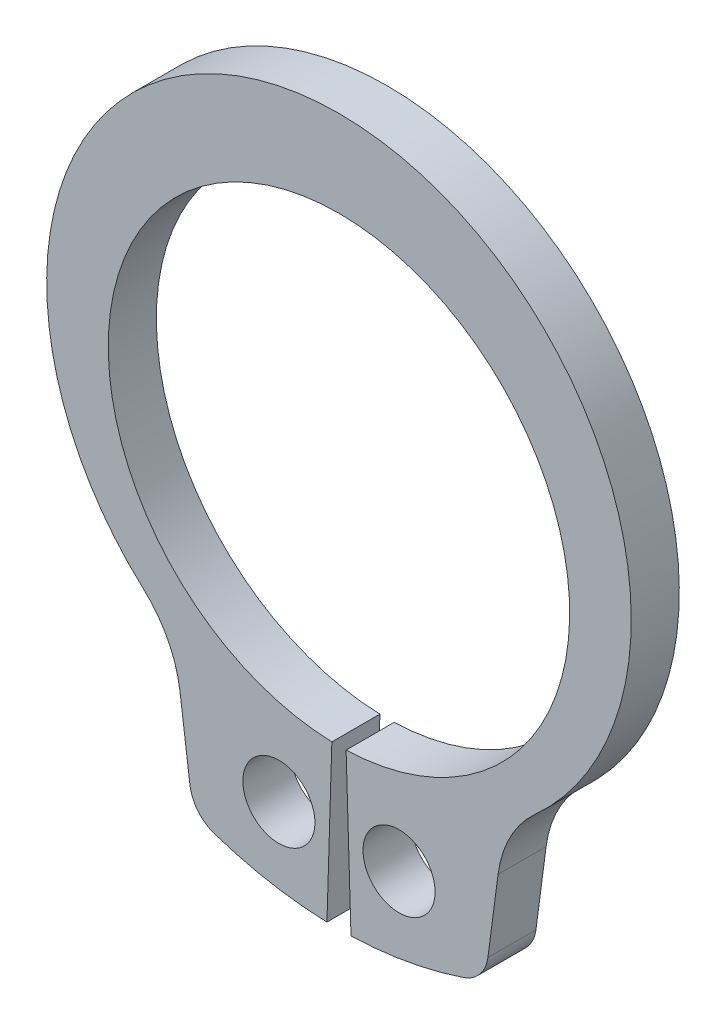
ISO-10303-21;
HEADER;
FILE_DESCRIPTION(('STEP AP214'),'2;1');
FILE_NAME('part.step','',(''),(''),'','','');
FILE_SCHEMA(('AUTOMOTIVE_DESIGN { 1 0 10303 214 1 1 1 1 }'));
ENDSEC;
DATA;
#1=APPLICATION_CONTEXT('core data for automotive mechanical design processes');
#2=APPLICATION_PROTOCOL_DEFINITION('international standard','automotive_design',2000,#1);
#3=PRODUCT_CONTEXT('',#1,'mechanical');
#4=PRODUCT('Part','Part','',(#3));
#5=PRODUCT_RELATED_PRODUCT_CATEGORY('part','',(#4));
#6=PRODUCT_DEFINITION_FORMATION('','',#4);
#7=PRODUCT_DEFINITION_CONTEXT('part definition',#1,'design');
#8=PRODUCT_DEFINITION('design','',#6,#7);
#9=PRODUCT_DEFINITION_SHAPE('','',#8);
#10=(LENGTH_UNIT() NAMED_UNIT(*) SI_UNIT(.MILLI.,.METRE.));
#11=(NAMED_UNIT(*) PLANE_ANGLE_UNIT() SI_UNIT($,.RADIAN.));
#12=(NAMED_UNIT(*) SI_UNIT($,.STERADIAN.) SOLID_ANGLE_UNIT());
#13=UNCERTAINTY_MEASURE_WITH_UNIT(LENGTH_MEASURE(1.E-05),#10,'distance_accuracy_value','');
#14=(GEOMETRIC_REPRESENTATION_CONTEXT(3) GLOBAL_UNCERTAINTY_ASSIGNED_CONTEXT((#13)) GLOBAL_UNIT_ASSIGNED_CONTEXT((#10,
#11,#12)) REPRESENTATION_CONTEXT('',''));
#15=CARTESIAN_POINT('',(0.,0.,0.));
#16=DIRECTION('',(0.,0.,1.));
#17=DIRECTION('',(1.,0.,0.));
#18=AXIS2_PLACEMENT_3D('',#15,#16,#17);
#19=CARTESIAN_POINT('',(0.,0.,-1.));
#20=DIRECTION('',(0.,0.,1.));
#21=DIRECTION('',(1.,0.,0.));
#22=AXIS2_PLACEMENT_3D('',#19,#20,#21);
#23=CYLINDRICAL_SURFACE('',#22,4.8);
#24=CARTESIAN_POINT('',(0.,0.,0.));
#25=DIRECTION('',(0.,0.,-1.));
#26=DIRECTION('',(1.,0.,0.));
#27=AXIS2_PLACEMENT_3D('',#24,#25,#26);
#28=CIRCLE('',#27,4.8);
#29=CARTESIAN_POINT('',(-0.148148148148148,-4.79771321841982,0.));
#30=VERTEX_POINT('',#29);
#31=CARTESIAN_POINT('',(0.148148148148148,-4.79771321841982,0.));
#32=VERTEX_POINT('',#31);
#33=EDGE_CURVE('E153',#30,#32,#28,.T.);
#34=ORIENTED_EDGE('',*,*,#33,.F.);
#35=DIRECTION('',(0.,0.,1.));
#36=VECTOR('',#35,1.);
#37=CARTESIAN_POINT('',(-0.148148148148148,-4.79771321841982,-1.));
#38=LINE('',#37,#36);
#39=CARTESIAN_POINT('',(-0.148148148148148,-4.79771321841982,-1.));
#40=VERTEX_POINT('',#39);
#41=EDGE_CURVE('E11',#40,#30,#38,.T.);
#42=ORIENTED_EDGE('',*,*,#41,.F.);
#43=CARTESIAN_POINT('',(0.,0.,-1.));
#44=DIRECTION('',(0.,0.,-1.));
#45=DIRECTION('',(1.,0.,0.));
#46=AXIS2_PLACEMENT_3D('',#43,#44,#45);
#47=CIRCLE('',#46,4.8);
#48=CARTESIAN_POINT('',(0.148148148148148,-4.79771321841982,-1.));
#49=VERTEX_POINT('',#48);
#50=EDGE_CURVE('E186',#40,#49,#47,.T.);
#51=ORIENTED_EDGE('',*,*,#50,.T.);
#52=DIRECTION('',(0.,0.,1.));
#53=VECTOR('',#52,1.);
#54=CARTESIAN_POINT('',(0.148148148148148,-4.79771321841982,-1.));
#55=LINE('',#54,#53);
#56=EDGE_CURVE('E35',#49,#32,#55,.T.);
#57=ORIENTED_EDGE('',*,*,#56,.T.);
#58=EDGE_LOOP('',(#34,#42,#51,#57));
#59=FACE_BOUND('',#58,.T.);
#60=ADVANCED_FACE('F32',(#59),#23,.F.);
#61=CARTESIAN_POINT('',(-0.148148148148148,-4.79771321841982,-1.));
#62=DIRECTION('',(0.999523587170796,-0.0308641975308642,0.));
#63=DIRECTION('',(0.0308641975308642,0.999523587170796,0.));
#64=AXIS2_PLACEMENT_3D('',#61,#62,#63);
#65=PLANE('',#64);
#66=DIRECTION('',(0.0308641975308642,0.999523587170796,0.));
#67=VECTOR('',#66,1.);
#68=CARTESIAN_POINT('',(-0.148148148148148,-4.79771321841982,0.));
#69=LINE('',#68,#67);
#70=CARTESIAN_POINT('',(-0.25,-8.09614105608345,0.));
#71=VERTEX_POINT('',#70);
#72=EDGE_CURVE('E184',#71,#30,#69,.T.);
#73=ORIENTED_EDGE('',*,*,#72,.F.);
#74=DIRECTION('',(0.,0.,1.));
#75=VECTOR('',#74,1.);
#76=CARTESIAN_POINT('',(-0.25,-8.09614105608345,-1.));
#77=LINE('',#76,#75);
#78=CARTESIAN_POINT('',(-0.25,-8.09614105608345,-1.));
#79=VERTEX_POINT('',#78);
#80=EDGE_CURVE('E41',#79,#71,#77,.T.);
#81=ORIENTED_EDGE('',*,*,#80,.F.);
#82=DIRECTION('',(0.0308641975308642,0.999523587170796,0.));
#83=VECTOR('',#82,1.);
#84=CARTESIAN_POINT('',(-0.148148148148148,-4.79771321841982,-1.));
#85=LINE('',#84,#83);
#86=EDGE_CURVE('E143',#79,#40,#85,.T.);
#87=ORIENTED_EDGE('',*,*,#86,.T.);
#88=ORIENTED_EDGE('',*,*,#41,.T.);
#89=EDGE_LOOP('',(#73,#81,#87,#88));
#90=FACE_BOUND('',#89,.T.);
#91=ADVANCED_FACE('F206',(#90),#65,.T.);
#92=CARTESIAN_POINT('',(0.,0.,-1.));
#93=DIRECTION('',(0.,0.,1.));
#94=DIRECTION('',(1.,0.,0.));
#95=AXIS2_PLACEMENT_3D('',#92,#93,#94);
#96=CYLINDRICAL_SURFACE('',#95,8.1);
#97=CARTESIAN_POINT('',(0.,0.,0.));
#98=DIRECTION('',(0.,0.,1.));
#99=DIRECTION('',(1.,0.,0.));
#100=AXIS2_PLACEMENT_3D('',#97,#98,#99);
#101=CIRCLE('',#100,8.1);
#102=CARTESIAN_POINT('',(-2.59511535496144,-7.67302914724317,0.));
#103=VERTEX_POINT('',#102);
#104=EDGE_CURVE('E130',#103,#71,#101,.T.);
#105=ORIENTED_EDGE('',*,*,#104,.F.);
#106=DIRECTION('',(0.,0.,1.));
#107=VECTOR('',#106,1.);
#108=CARTESIAN_POINT('',(-2.59511535496144,-7.67302914724317,-1.));
#109=LINE('',#108,#107);
#110=CARTESIAN_POINT('',(-2.59511535496144,-7.67302914724317,-1.));
#111=VERTEX_POINT('',#110);
#112=EDGE_CURVE('E125',#111,#103,#109,.T.);
#113=ORIENTED_EDGE('',*,*,#112,.F.);
#114=CARTESIAN_POINT('',(0.,0.,-1.));
#115=DIRECTION('',(0.,0.,1.));
#116=DIRECTION('',(1.,0.,0.));
#117=AXIS2_PLACEMENT_3D('',#114,#115,#116);
#118=CIRCLE('',#117,8.1);
#119=EDGE_CURVE('E128',#111,#79,#118,.T.);
#120=ORIENTED_EDGE('',*,*,#119,.T.);
#121=ORIENTED_EDGE('',*,*,#80,.T.);
#122=EDGE_LOOP('',(#105,#113,#120,#121));
#123=FACE_BOUND('',#122,.T.);
#124=ADVANCED_FACE('F127',(#123),#96,.T.);
#125=CARTESIAN_POINT('',(-2.35482689616871,-6.9625634854614,-1.));
#126=DIRECTION('',(0.,0.,1.));
#127=DIRECTION('',(1.,0.,0.));
#128=AXIS2_PLACEMENT_3D('',#125,#126,#127);
#129=CYLINDRICAL_SURFACE('',#128,0.750000000000001);
#130=CARTESIAN_POINT('',(-2.35482689616871,-6.9625634854614,0.));
#131=DIRECTION('',(0.,0.,1.));
#132=DIRECTION('',(1.,0.,0.));
#133=AXIS2_PLACEMENT_3D('',#130,#131,#132);
#134=CIRCLE('',#133,0.750000000000001);
#135=CARTESIAN_POINT('',(-3.09841054219907,-7.06045812962644,0.));
#136=VERTEX_POINT('',#135);
#137=EDGE_CURVE('E181',#136,#103,#134,.T.);
#138=ORIENTED_EDGE('',*,*,#137,.F.);
#139=DIRECTION('',(0.,0.,1.));
#140=VECTOR('',#139,1.);
#141=CARTESIAN_POINT('',(-3.09841054219907,-7.06045812962644,-1.));
#142=LINE('',#141,#140);
#143=CARTESIAN_POINT('',(-3.09841054219907,-7.06045812962644,-1.));
#144=VERTEX_POINT('',#143);
#145=EDGE_CURVE('E135',#144,#136,#142,.T.);
#146=ORIENTED_EDGE('',*,*,#145,.F.);
#147=CARTESIAN_POINT('',(-2.35482689616871,-6.9625634854614,-1.));
#148=DIRECTION('',(0.,0.,1.));
#149=DIRECTION('',(1.,0.,0.));
#150=AXIS2_PLACEMENT_3D('',#147,#148,#149);
#151=CIRCLE('',#150,0.750000000000001);
#152=EDGE_CURVE('E141',#144,#111,#151,.T.);
#153=ORIENTED_EDGE('',*,*,#152,.T.);
#154=ORIENTED_EDGE('',*,*,#112,.T.);
#155=EDGE_LOOP('',(#138,#146,#153,#154));
#156=FACE_BOUND('',#155,.T.);
#157=ADVANCED_FACE('F145',(#156),#129,.T.);
#158=CARTESIAN_POINT('',(-3.30965181475856,-5.45592136480539,-1.));
#159=DIRECTION('',(-0.99144486137381,-0.130526192220052,0.));
#160=DIRECTION('',(0.130526192220052,-0.99144486137381,0.));
#161=AXIS2_PLACEMENT_3D('',#158,#159,#160);
#162=PLANE('',#161);
#163=DIRECTION('',(0.130526192220052,-0.99144486137381,0.));
#164=VECTOR('',#163,1.);
#165=CARTESIAN_POINT('',(-3.30965181475856,-5.45592136480539,0.));
#166=LINE('',#165,#164);
#167=CARTESIAN_POINT('',(-3.30965181475856,-5.45592136480539,0.));
#168=VERTEX_POINT('',#167);
#169=EDGE_CURVE('E178',#168,#136,#166,.T.);
#170=ORIENTED_EDGE('',*,*,#169,.F.);
#171=DIRECTION('',(0.,0.,1.));
#172=VECTOR('',#171,1.);
#173=CARTESIAN_POINT('',(-3.30965181475856,-5.45592136480539,-1.));
#174=LINE('',#173,#172);
#175=CARTESIAN_POINT('',(-3.30965181475856,-5.45592136480539,-1.));
#176=VERTEX_POINT('',#175);
#177=EDGE_CURVE('E190',#176,#168,#174,.T.);
#178=ORIENTED_EDGE('',*,*,#177,.F.);
#179=DIRECTION('',(0.130526192220052,-0.99144486137381,0.));
#180=VECTOR('',#179,1.);
#181=CARTESIAN_POINT('',(-3.30965181475856,-5.45592136480539,-1.));
#182=LINE('',#181,#180);
#183=EDGE_CURVE('E146',#176,#144,#182,.T.);
#184=ORIENTED_EDGE('',*,*,#183,.T.);
#185=ORIENTED_EDGE('',*,*,#145,.T.);
#186=EDGE_LOOP('',(#170,#178,#184,#185));
#187=FACE_BOUND('',#186,.T.);
#188=ADVANCED_FACE('F219',(#187),#162,.T.);
#189=CARTESIAN_POINT('',(-5.68605087745158,-5.76878023667328,-1.));
#190=DIRECTION('',(0.,0.,1.));
#191=DIRECTION('',(1.,0.,0.));
#192=AXIS2_PLACEMENT_3D('',#189,#190,#191);
#193=CYLINDRICAL_SURFACE('',#192,2.3969049165277);
#194=CARTESIAN_POINT('',(-5.68605087745158,-5.76878023667328,0.));
#195=DIRECTION('',(0.,0.,-1.));
#196=DIRECTION('',(1.,0.,0.));
#197=AXIS2_PLACEMENT_3D('',#194,#195,#196);
#198=CIRCLE('',#197,2.3969049165277);
#199=CARTESIAN_POINT('',(-4.07842108653022,-3.99095020142895,0.));
#200=VERTEX_POINT('',#199);
#201=EDGE_CURVE('E175',#200,#168,#198,.T.);
#202=ORIENTED_EDGE('',*,*,#201,.F.);
#203=DIRECTION('',(0.,0.,1.));
#204=VECTOR('',#203,1.);
#205=CARTESIAN_POINT('',(-4.07842108653022,-3.99095020142895,-1.));
#206=LINE('',#205,#204);
#207=CARTESIAN_POINT('',(-4.07842108653022,-3.99095020142895,-1.));
#208=VERTEX_POINT('',#207);
#209=EDGE_CURVE('E192',#208,#200,#206,.T.);
#210=ORIENTED_EDGE('',*,*,#209,.F.);
#211=CARTESIAN_POINT('',(-5.68605087745158,-5.76878023667328,-1.));
#212=DIRECTION('',(0.,0.,-1.));
#213=DIRECTION('',(1.,0.,0.));
#214=AXIS2_PLACEMENT_3D('',#211,#212,#213);
#215=CIRCLE('',#214,2.3969049165277);
#216=EDGE_CURVE('E148',#208,#176,#215,.T.);
#217=ORIENTED_EDGE('',*,*,#216,.T.);
#218=ORIENTED_EDGE('',*,*,#177,.T.);
#219=EDGE_LOOP('',(#202,#210,#217,#218));
#220=FACE_BOUND('',#219,.T.);
#221=ADVANCED_FACE('F222',(#220),#193,.F.);
#222=CARTESIAN_POINT('',(0.,0.519254539086393,-1.));
#223=DIRECTION('',(0.,0.,1.));
#224=DIRECTION('',(1.,0.,0.));
#225=AXIS2_PLACEMENT_3D('',#222,#223,#224);
#226=CYLINDRICAL_SURFACE('',#225,6.08074546091361);
#227=CARTESIAN_POINT('',(0.,0.519254539086393,0.));
#228=DIRECTION('',(0.,0.,1.));
#229=DIRECTION('',(1.,0.,0.));
#230=AXIS2_PLACEMENT_3D('',#227,#228,#229);
#231=CIRCLE('',#230,6.08074546091361);
#232=CARTESIAN_POINT('',(4.07842108653022,-3.99095020142896,0.));
#233=VERTEX_POINT('',#232);
#234=EDGE_CURVE('E172',#233,#200,#231,.T.);
#235=ORIENTED_EDGE('',*,*,#234,.F.);
#236=DIRECTION('',(0.,0.,1.));
#237=VECTOR('',#236,1.);
#238=CARTESIAN_POINT('',(4.07842108653022,-3.99095020142896,-1.));
#239=LINE('',#238,#237);
#240=CARTESIAN_POINT('',(4.07842108653022,-3.99095020142896,-1.));
#241=VERTEX_POINT('',#240);
#242=EDGE_CURVE('E194',#241,#233,#239,.T.);
#243=ORIENTED_EDGE('',*,*,#242,.F.);
#244=CARTESIAN_POINT('',(0.,0.519254539086393,-1.));
#245=DIRECTION('',(0.,0.,1.));
#246=DIRECTION('',(1.,0.,0.));
#247=AXIS2_PLACEMENT_3D('',#244,#245,#246);
#248=CIRCLE('',#247,6.08074546091361);
#249=EDGE_CURVE('E296',#241,#208,#248,.T.);
#250=ORIENTED_EDGE('',*,*,#249,.T.);
#251=ORIENTED_EDGE('',*,*,#209,.T.);
#252=EDGE_LOOP('',(#235,#243,#250,#251));
#253=FACE_BOUND('',#252,.T.);
#254=ADVANCED_FACE('F226',(#253),#226,.T.);
#255=CARTESIAN_POINT('',(5.68605087745158,-5.76878023667328,-1.));
#256=DIRECTION('',(0.,0.,1.));
#257=DIRECTION('',(1.,0.,0.));
#258=AXIS2_PLACEMENT_3D('',#255,#256,#257);
#259=CYLINDRICAL_SURFACE('',#258,2.3969049165277);
#260=CARTESIAN_POINT('',(5.68605087745158,-5.76878023667328,0.));
#261=DIRECTION('',(0.,0.,-1.));
#262=DIRECTION('',(1.,0.,0.));
#263=AXIS2_PLACEMENT_3D('',#260,#261,#262);
#264=CIRCLE('',#263,2.3969049165277);
#265=CARTESIAN_POINT('',(3.30965181475856,-5.45592136480539,0.));
#266=VERTEX_POINT('',#265);
#267=EDGE_CURVE('E169',#266,#233,#264,.T.);
#268=ORIENTED_EDGE('',*,*,#267,.F.);
#269=DIRECTION('',(0.,0.,1.));
#270=VECTOR('',#269,1.);
#271=CARTESIAN_POINT('',(3.30965181475856,-5.45592136480539,-1.));
#272=LINE('',#271,#270);
#273=CARTESIAN_POINT('',(3.30965181475856,-5.45592136480539,-1.));
#274=VERTEX_POINT('',#273);
#275=EDGE_CURVE('E196',#274,#266,#272,.T.);
#276=ORIENTED_EDGE('',*,*,#275,.F.);
#277=CARTESIAN_POINT('',(5.68605087745158,-5.76878023667328,-1.));
#278=DIRECTION('',(0.,0.,-1.));
#279=DIRECTION('',(1.,0.,0.));
#280=AXIS2_PLACEMENT_3D('',#277,#278,#279);
#281=CIRCLE('',#280,2.3969049165277);
#282=EDGE_CURVE('E293',#274,#241,#281,.T.);
#283=ORIENTED_EDGE('',*,*,#282,.T.);
#284=ORIENTED_EDGE('',*,*,#242,.T.);
#285=EDGE_LOOP('',(#268,#276,#283,#284));
#286=FACE_BOUND('',#285,.T.);
#287=ADVANCED_FACE('F230',(#286),#259,.F.);
#288=CARTESIAN_POINT('',(3.30965181475856,-5.45592136480539,-1.));
#289=DIRECTION('',(0.99144486137381,-0.130526192220052,0.));
#290=DIRECTION('',(0.130526192220052,0.99144486137381,0.));
#291=AXIS2_PLACEMENT_3D('',#288,#289,#290);
#292=PLANE('',#291);
#293=DIRECTION('',(0.130526192220052,0.99144486137381,0.));
#294=VECTOR('',#293,1.);
#295=CARTESIAN_POINT('',(3.30965181475856,-5.45592136480539,0.));
#296=LINE('',#295,#294);
#297=CARTESIAN_POINT('',(3.09841054219907,-7.06045812962644,0.));
#298=VERTEX_POINT('',#297);
#299=EDGE_CURVE('E166',#298,#266,#296,.T.);
#300=ORIENTED_EDGE('',*,*,#299,.F.);
#301=DIRECTION('',(0.,0.,1.));
#302=VECTOR('',#301,1.);
#303=CARTESIAN_POINT('',(3.09841054219907,-7.06045812962644,-1.));
#304=LINE('',#303,#302);
#305=CARTESIAN_POINT('',(3.09841054219907,-7.06045812962644,-1.));
#306=VERTEX_POINT('',#305);
#307=EDGE_CURVE('E198',#306,#298,#304,.T.);
#308=ORIENTED_EDGE('',*,*,#307,.F.);
#309=DIRECTION('',(0.130526192220052,0.99144486137381,0.));
#310=VECTOR('',#309,1.);
#311=CARTESIAN_POINT('',(3.30965181475856,-5.45592136480539,-1.));
#312=LINE('',#311,#310);
#313=EDGE_CURVE('E290',#306,#274,#312,.T.);
#314=ORIENTED_EDGE('',*,*,#313,.T.);
#315=ORIENTED_EDGE('',*,*,#275,.T.);
#316=EDGE_LOOP('',(#300,#308,#314,#315));
#317=FACE_BOUND('',#316,.T.);
#318=ADVANCED_FACE('F234',(#317),#292,.T.);
#319=CARTESIAN_POINT('',(2.35482689616871,-6.9625634854614,-1.));
#320=DIRECTION('',(0.,0.,1.));
#321=DIRECTION('',(1.,0.,0.));
#322=AXIS2_PLACEMENT_3D('',#319,#320,#321);
#323=CYLINDRICAL_SURFACE('',#322,0.750000000000001);
#324=CARTESIAN_POINT('',(2.35482689616871,-6.9625634854614,0.));
#325=DIRECTION('',(0.,0.,1.));
#326=DIRECTION('',(-1.,0.,0.));
#327=AXIS2_PLACEMENT_3D('',#324,#325,#326);
#328=CIRCLE('',#327,0.750000000000001);
#329=CARTESIAN_POINT('',(2.59511535496144,-7.67302914724318,0.));
#330=VERTEX_POINT('',#329);
#331=EDGE_CURVE('E163',#330,#298,#328,.T.);
#332=ORIENTED_EDGE('',*,*,#331,.F.);
#333=DIRECTION('',(0.,0.,1.));
#334=VECTOR('',#333,1.);
#335=CARTESIAN_POINT('',(2.59511535496144,-7.67302914724318,-1.));
#336=LINE('',#335,#334);
#337=CARTESIAN_POINT('',(2.59511535496144,-7.67302914724318,-1.));
#338=VERTEX_POINT('',#337);
#339=EDGE_CURVE('E200',#338,#330,#336,.T.);
#340=ORIENTED_EDGE('',*,*,#339,.F.);
#341=CARTESIAN_POINT('',(2.35482689616871,-6.9625634854614,-1.));
#342=DIRECTION('',(0.,0.,1.));
#343=DIRECTION('',(-1.,0.,0.));
#344=AXIS2_PLACEMENT_3D('',#341,#342,#343);
#345=CIRCLE('',#344,0.750000000000001);
#346=EDGE_CURVE('E287',#338,#306,#345,.T.);
#347=ORIENTED_EDGE('',*,*,#346,.T.);
#348=ORIENTED_EDGE('',*,*,#307,.T.);
#349=EDGE_LOOP('',(#332,#340,#347,#348));
#350=FACE_BOUND('',#349,.T.);
#351=ADVANCED_FACE('F238',(#350),#323,.T.);
#352=CARTESIAN_POINT('',(0.,0.,-1.));
#353=DIRECTION('',(0.,0.,1.));
#354=DIRECTION('',(1.,0.,0.));
#355=AXIS2_PLACEMENT_3D('',#352,#353,#354);
#356=CYLINDRICAL_SURFACE('',#355,8.1);
#357=CARTESIAN_POINT('',(0.,0.,0.));
#358=DIRECTION('',(0.,0.,1.));
#359=DIRECTION('',(1.,0.,0.));
#360=AXIS2_PLACEMENT_3D('',#357,#358,#359);
#361=CIRCLE('',#360,8.1);
#362=CARTESIAN_POINT('',(0.249999999999997,-8.09614105608345,0.));
#363=VERTEX_POINT('',#362);
#364=EDGE_CURVE('E160',#363,#330,#361,.T.);
#365=ORIENTED_EDGE('',*,*,#364,.F.);
#366=DIRECTION('',(0.,0.,1.));
#367=VECTOR('',#366,1.);
#368=CARTESIAN_POINT('',(0.249999999999997,-8.09614105608345,-1.));
#369=LINE('',#368,#367);
#370=CARTESIAN_POINT('',(0.249999999999997,-8.09614105608345,-1.));
#371=VERTEX_POINT('',#370);
#372=EDGE_CURVE('E201',#371,#363,#369,.T.);
#373=ORIENTED_EDGE('',*,*,#372,.F.);
#374=CARTESIAN_POINT('',(0.,0.,-1.));
#375=DIRECTION('',(0.,0.,1.));
#376=DIRECTION('',(1.,0.,0.));
#377=AXIS2_PLACEMENT_3D('',#374,#375,#376);
#378=CIRCLE('',#377,8.1);
#379=EDGE_CURVE('E284',#371,#338,#378,.T.);
#380=ORIENTED_EDGE('',*,*,#379,.T.);
#381=ORIENTED_EDGE('',*,*,#339,.T.);
#382=EDGE_LOOP('',(#365,#373,#380,#381));
#383=FACE_BOUND('',#382,.T.);
#384=ADVANCED_FACE('F242',(#383),#356,.T.);
#385=CARTESIAN_POINT('',(0.148148148148148,-4.79771321841982,-1.));
#386=DIRECTION('',(-0.999523587170796,-0.0308641975308642,0.));
#387=DIRECTION('',(0.0308641975308642,-0.999523587170796,0.));
#388=AXIS2_PLACEMENT_3D('',#385,#386,#387);
#389=PLANE('',#388);
#390=DIRECTION('',(0.0308641975308642,-0.999523587170796,0.));
#391=VECTOR('',#390,1.);
#392=CARTESIAN_POINT('',(0.148148148148148,-4.79771321841982,0.));
#393=LINE('',#392,#391);
#394=EDGE_CURVE('E156',#32,#363,#393,.T.);
#395=ORIENTED_EDGE('',*,*,#394,.F.);
#396=ORIENTED_EDGE('',*,*,#56,.F.);
#397=DIRECTION('',(0.0308641975308642,-0.999523587170796,0.));
#398=VECTOR('',#397,1.);
#399=CARTESIAN_POINT('',(0.148148148148148,-4.79771321841982,-1.));
#400=LINE('',#399,#398);
#401=EDGE_CURVE('E282',#49,#371,#400,.T.);
#402=ORIENTED_EDGE('',*,*,#401,.T.);
#403=ORIENTED_EDGE('',*,*,#372,.T.);
#404=EDGE_LOOP('',(#395,#396,#402,#403));
#405=FACE_BOUND('',#404,.T.);
#406=ADVANCED_FACE('F203',(#405),#389,.T.);
#407=CARTESIAN_POINT('',(0.,0.,-1.));
#408=DIRECTION('',(0.,0.,1.));
#409=DIRECTION('',(1.,0.,0.));
#410=AXIS2_PLACEMENT_3D('',#407,#408,#409);
#411=PLANE('',#410);
#412=CARTESIAN_POINT('',(-1.25,-6.4296189622714,-1.));
#413=DIRECTION('',(0.,0.,1.));
#414=DIRECTION('',(1.,0.,0.));
#415=AXIS2_PLACEMENT_3D('',#412,#413,#414);
#416=CIRCLE('',#415,0.75);
#417=CARTESIAN_POINT('',(-0.5,-6.4296189622714,-1.));
#418=VERTEX_POINT('',#417);
#419=EDGE_CURVE('E269',#418,#418,#416,.T.);
#420=ORIENTED_EDGE('',*,*,#419,.T.);
#421=EDGE_LOOP('',(#420));
#422=FACE_BOUND('',#421,.T.);
#423=CARTESIAN_POINT('',(1.25,-6.4296189622714,-1.));
#424=DIRECTION('',(0.,0.,1.));
#425=DIRECTION('',(1.,0.,0.));
#426=AXIS2_PLACEMENT_3D('',#423,#424,#425);
#427=CIRCLE('',#426,0.75);
#428=CARTESIAN_POINT('',(2.,-6.4296189622714,-1.));
#429=VERTEX_POINT('',#428);
#430=EDGE_CURVE('E157',#429,#429,#427,.T.);
#431=ORIENTED_EDGE('',*,*,#430,.T.);
#432=EDGE_LOOP('',(#431));
#433=FACE_BOUND('',#432,.T.);
#434=ORIENTED_EDGE('',*,*,#50,.F.);
#435=ORIENTED_EDGE('',*,*,#86,.F.);
#436=ORIENTED_EDGE('',*,*,#119,.F.);
#437=ORIENTED_EDGE('',*,*,#152,.F.);
#438=ORIENTED_EDGE('',*,*,#183,.F.);
#439=ORIENTED_EDGE('',*,*,#216,.F.);
#440=ORIENTED_EDGE('',*,*,#249,.F.);
#441=ORIENTED_EDGE('',*,*,#282,.F.);
#442=ORIENTED_EDGE('',*,*,#313,.F.);
#443=ORIENTED_EDGE('',*,*,#346,.F.);
#444=ORIENTED_EDGE('',*,*,#379,.F.);
#445=ORIENTED_EDGE('',*,*,#401,.F.);
#446=EDGE_LOOP('',(#434,#435,#436,#437,#438,#439,#440,#441,#442,#443,#444,#445));
#447=FACE_BOUND('',#446,.T.);
#448=ADVANCED_FACE('F139',(#422,#433,#447),#411,.F.);
#449=CARTESIAN_POINT('',(0.,0.,0.));
#450=DIRECTION('',(0.,0.,1.));
#451=DIRECTION('',(1.,0.,0.));
#452=AXIS2_PLACEMENT_3D('',#449,#450,#451);
#453=PLANE('',#452);
#454=CARTESIAN_POINT('',(-1.25,-6.4296189622714,0.));
#455=DIRECTION('',(0.,0.,1.));
#456=DIRECTION('',(1.,0.,0.));
#457=AXIS2_PLACEMENT_3D('',#454,#455,#456);
#458=CIRCLE('',#457,0.75);
#459=CARTESIAN_POINT('',(-0.5,-6.4296189622714,0.));
#460=VERTEX_POINT('',#459);
#461=EDGE_CURVE('E272',#460,#460,#458,.T.);
#462=ORIENTED_EDGE('',*,*,#461,.F.);
#463=EDGE_LOOP('',(#462));
#464=FACE_BOUND('',#463,.T.);
#465=CARTESIAN_POINT('',(1.25,-6.4296189622714,0.));
#466=DIRECTION('',(0.,0.,1.));
#467=DIRECTION('',(1.,0.,0.));
#468=AXIS2_PLACEMENT_3D('',#465,#466,#467);
#469=CIRCLE('',#468,0.75);
#470=CARTESIAN_POINT('',(2.,-6.4296189622714,0.));
#471=VERTEX_POINT('',#470);
#472=EDGE_CURVE('E274',#471,#471,#469,.T.);
#473=ORIENTED_EDGE('',*,*,#472,.F.);
#474=EDGE_LOOP('',(#473));
#475=FACE_BOUND('',#474,.T.);
#476=ORIENTED_EDGE('',*,*,#33,.T.);
#477=ORIENTED_EDGE('',*,*,#394,.T.);
#478=ORIENTED_EDGE('',*,*,#364,.T.);
#479=ORIENTED_EDGE('',*,*,#331,.T.);
#480=ORIENTED_EDGE('',*,*,#299,.T.);
#481=ORIENTED_EDGE('',*,*,#267,.T.);
#482=ORIENTED_EDGE('',*,*,#234,.T.);
#483=ORIENTED_EDGE('',*,*,#201,.T.);
#484=ORIENTED_EDGE('',*,*,#169,.T.);
#485=ORIENTED_EDGE('',*,*,#137,.T.);
#486=ORIENTED_EDGE('',*,*,#104,.T.);
#487=ORIENTED_EDGE('',*,*,#72,.T.);
#488=EDGE_LOOP('',(#476,#477,#478,#479,#480,#481,#482,#483,#484,#485,#486,#487));
#489=FACE_BOUND('',#488,.T.);
#490=ADVANCED_FACE('F205',(#464,#475,#489),#453,.T.);
#491=CARTESIAN_POINT('',(1.25,-6.4296189622714,-1.));
#492=DIRECTION('',(0.,0.,1.));
#493=DIRECTION('',(1.,0.,0.));
#494=AXIS2_PLACEMENT_3D('',#491,#492,#493);
#495=CYLINDRICAL_SURFACE('',#494,0.75);
#496=ORIENTED_EDGE('',*,*,#430,.F.);
#497=EDGE_LOOP('',(#496));
#498=FACE_BOUND('',#497,.T.);
#499=ORIENTED_EDGE('',*,*,#472,.T.);
#500=EDGE_LOOP('',(#499));
#501=FACE_BOUND('',#500,.T.);
#502=ADVANCED_FACE('F254',(#498,#501),#495,.F.);
#503=CARTESIAN_POINT('',(-1.25,-6.4296189622714,-1.));
#504=DIRECTION('',(0.,0.,1.));
#505=DIRECTION('',(1.,0.,0.));
#506=AXIS2_PLACEMENT_3D('',#503,#504,#505);
#507=CYLINDRICAL_SURFACE('',#506,0.75);
#508=ORIENTED_EDGE('',*,*,#419,.F.);
#509=EDGE_LOOP('',(#508));
#510=FACE_BOUND('',#509,.T.);
#511=ORIENTED_EDGE('',*,*,#461,.T.);
#512=EDGE_LOOP('',(#511));
#513=FACE_BOUND('',#512,.T.);
#514=ADVANCED_FACE('F261',(#510,#513),#507,.F.);
#515=CLOSED_SHELL('',(#60,#91,#124,#157,#188,#221,#254,#287,#318,#351,#384,#406,#448,#490,#502,#514));
#516=MANIFOLD_SOLID_BREP('B2',#515);
#517=ADVANCED_BREP_SHAPE_REPRESENTATION('',(#18,#516),#14);
#518=SHAPE_DEFINITION_REPRESENTATION(#9,#517);
ENDSEC;
END-ISO-10303-21;
